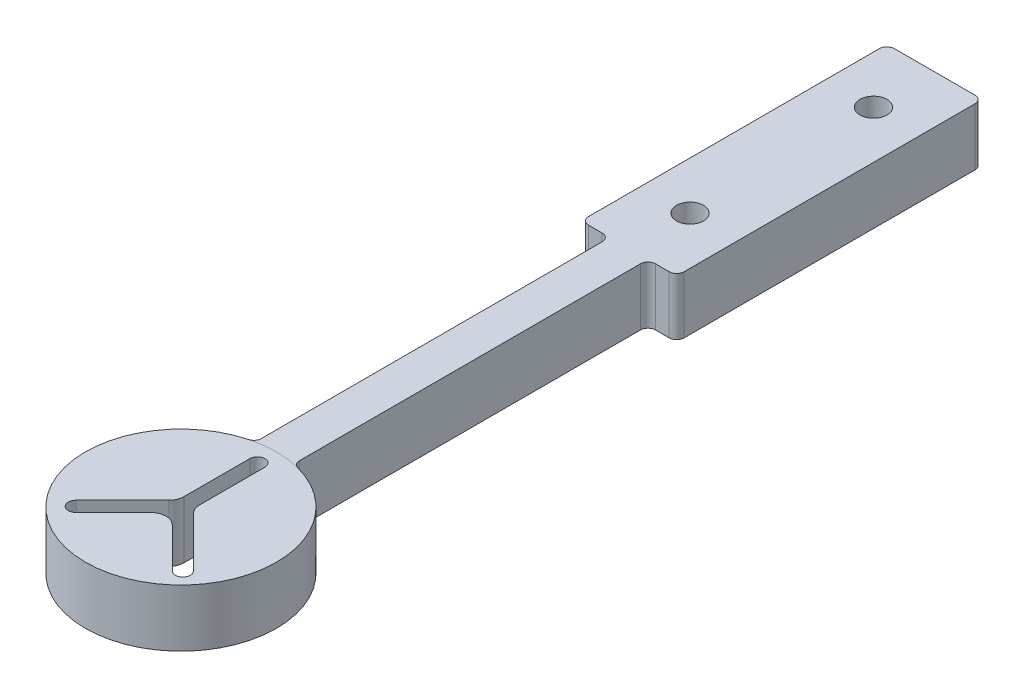
ISO-10303-21;
HEADER;
FILE_DESCRIPTION(('STEP AP214'),'2;1');
FILE_NAME('part.step','',(''),(''),'','','');
FILE_SCHEMA(('AUTOMOTIVE_DESIGN { 1 0 10303 214 1 1 1 1 }'));
ENDSEC;
DATA;
#1=APPLICATION_CONTEXT('core data for automotive mechanical design processes');
#2=APPLICATION_PROTOCOL_DEFINITION('international standard','automotive_design',2000,#1);
#3=PRODUCT_CONTEXT('',#1,'mechanical');
#4=PRODUCT('Part','Part','',(#3));
#5=PRODUCT_RELATED_PRODUCT_CATEGORY('part','',(#4));
#6=PRODUCT_DEFINITION_FORMATION('','',#4);
#7=PRODUCT_DEFINITION_CONTEXT('part definition',#1,'design');
#8=PRODUCT_DEFINITION('design','',#6,#7);
#9=PRODUCT_DEFINITION_SHAPE('','',#8);
#10=(LENGTH_UNIT() NAMED_UNIT(*) SI_UNIT(.MILLI.,.METRE.));
#11=(NAMED_UNIT(*) PLANE_ANGLE_UNIT() SI_UNIT($,.RADIAN.));
#12=(NAMED_UNIT(*) SI_UNIT($,.STERADIAN.) SOLID_ANGLE_UNIT());
#13=UNCERTAINTY_MEASURE_WITH_UNIT(LENGTH_MEASURE(1.E-05),#10,'distance_accuracy_value','');
#14=(GEOMETRIC_REPRESENTATION_CONTEXT(3) GLOBAL_UNCERTAINTY_ASSIGNED_CONTEXT((#13)) GLOBAL_UNIT_ASSIGNED_CONTEXT((#10,
#11,#12)) REPRESENTATION_CONTEXT('',''));
#15=CARTESIAN_POINT('',(0.,0.,0.));
#16=DIRECTION('',(0.,0.,1.));
#17=DIRECTION('',(1.,0.,0.));
#18=AXIS2_PLACEMENT_3D('',#15,#16,#17);
#19=CARTESIAN_POINT('',(0.,9.525,74.422));
#20=DIRECTION('',(0.,1.,0.));
#21=DIRECTION('',(0.,0.,1.));
#22=AXIS2_PLACEMENT_3D('',#19,#20,#21);
#23=PLANE('',#22);
#24=CARTESIAN_POINT('',(0.,9.525,-40.64));
#25=DIRECTION('',(0.,1.,0.));
#26=DIRECTION('',(0.,0.,1.));
#27=AXIS2_PLACEMENT_3D('',#24,#25,#26);
#28=CIRCLE('',#27,2.2479);
#29=CARTESIAN_POINT('',(0.,9.525,-38.3921));
#30=VERTEX_POINT('',#29);
#31=EDGE_CURVE('E300',#30,#30,#28,.T.);
#32=ORIENTED_EDGE('',*,*,#31,.F.);
#33=EDGE_LOOP('',(#32));
#34=FACE_BOUND('',#33,.T.);
#35=CARTESIAN_POINT('',(0.,9.525,-10.16));
#36=DIRECTION('',(0.,1.,0.));
#37=DIRECTION('',(0.,0.,1.));
#38=AXIS2_PLACEMENT_3D('',#35,#36,#37);
#39=CIRCLE('',#38,2.2479);
#40=CARTESIAN_POINT('',(0.,9.525,-7.9121));
#41=VERTEX_POINT('',#40);
#42=EDGE_CURVE('E287',#41,#41,#39,.T.);
#43=ORIENTED_EDGE('',*,*,#42,.F.);
#44=EDGE_LOOP('',(#43));
#45=FACE_BOUND('',#44,.T.);
#46=CARTESIAN_POINT('',(-4.42499999999999,9.525,57.8785723019684));
#47=DIRECTION('',(0.,1.,0.));
#48=DIRECTION('',(0.,0.,1.));
#49=AXIS2_PLACEMENT_3D('',#46,#47,#48);
#50=CIRCLE('',#49,1.25);
#51=CARTESIAN_POINT('',(-3.17499999999999,9.525,57.8785723019684));
#52=VERTEX_POINT('',#51);
#53=CARTESIAN_POINT('',(-4.10200729927006,9.525,59.086121768978));
#54=VERTEX_POINT('',#53);
#55=EDGE_CURVE('E428',#52,#54,#50,.F.);
#56=ORIENTED_EDGE('',*,*,#55,.T.);
#57=CARTESIAN_POINT('',(0.,9.525,74.422));
#58=DIRECTION('',(0.,1.,0.));
#59=DIRECTION('',(0.,0.,1.));
#60=AXIS2_PLACEMENT_3D('',#57,#58,#59);
#61=CIRCLE('',#60,15.875);
#62=CARTESIAN_POINT('',(4.10200729927008,9.525,59.086121768978));
#63=VERTEX_POINT('',#62);
#64=EDGE_CURVE('E434',#54,#63,#61,.F.);
#65=ORIENTED_EDGE('',*,*,#64,.T.);
#66=CARTESIAN_POINT('',(4.42500000000001,9.525,57.8785723019684));
#67=DIRECTION('',(0.,1.,0.));
#68=DIRECTION('',(0.,0.,1.));
#69=AXIS2_PLACEMENT_3D('',#66,#67,#68);
#70=CIRCLE('',#69,1.25);
#71=CARTESIAN_POINT('',(3.17500000000001,9.525,57.8785723019684));
#72=VERTEX_POINT('',#71);
#73=EDGE_CURVE('E424',#63,#72,#70,.F.);
#74=ORIENTED_EDGE('',*,*,#73,.T.);
#75=DIRECTION('',(0.,0.,-1.));
#76=VECTOR('',#75,1.);
#77=CARTESIAN_POINT('',(3.175,9.525,0.));
#78=LINE('',#77,#76);
#79=CARTESIAN_POINT('',(3.175,9.525,1.25));
#80=VERTEX_POINT('',#79);
#81=EDGE_CURVE('E322',#72,#80,#78,.T.);
#82=ORIENTED_EDGE('',*,*,#81,.T.);
#83=CARTESIAN_POINT('',(4.425,9.525,1.25));
#84=DIRECTION('',(0.,1.,0.));
#85=DIRECTION('',(0.,0.,1.));
#86=AXIS2_PLACEMENT_3D('',#83,#84,#85);
#87=CIRCLE('',#86,1.25);
#88=CARTESIAN_POINT('',(4.425,9.525,0.));
#89=VERTEX_POINT('',#88);
#90=EDGE_CURVE('E420',#80,#89,#87,.F.);
#91=ORIENTED_EDGE('',*,*,#90,.T.);
#92=DIRECTION('',(1.,0.,0.));
#93=VECTOR('',#92,1.);
#94=CARTESIAN_POINT('',(3.175,9.525,0.));
#95=LINE('',#94,#93);
#96=CARTESIAN_POINT('',(6.6875,9.525,0.));
#97=VERTEX_POINT('',#96);
#98=EDGE_CURVE('E325',#89,#97,#95,.T.);
#99=ORIENTED_EDGE('',*,*,#98,.T.);
#100=CARTESIAN_POINT('',(6.6875,9.525,-1.25));
#101=DIRECTION('',(0.,1.,0.));
#102=DIRECTION('',(0.,0.,1.));
#103=AXIS2_PLACEMENT_3D('',#100,#101,#102);
#104=CIRCLE('',#103,1.25);
#105=CARTESIAN_POINT('',(7.9375,9.525,-1.25));
#106=VERTEX_POINT('',#105);
#107=EDGE_CURVE('E374',#97,#106,#104,.T.);
#108=ORIENTED_EDGE('',*,*,#107,.T.);
#109=DIRECTION('',(0.,0.,-1.));
#110=VECTOR('',#109,1.);
#111=CARTESIAN_POINT('',(7.9375,9.525,-50.8));
#112=LINE('',#111,#110);
#113=CARTESIAN_POINT('',(7.9375,9.525,-49.55));
#114=VERTEX_POINT('',#113);
#115=EDGE_CURVE('E328',#106,#114,#112,.T.);
#116=ORIENTED_EDGE('',*,*,#115,.T.);
#117=CARTESIAN_POINT('',(6.6875,9.525,-49.55));
#118=DIRECTION('',(0.,1.,0.));
#119=DIRECTION('',(0.,0.,1.));
#120=AXIS2_PLACEMENT_3D('',#117,#118,#119);
#121=CIRCLE('',#120,1.25);
#122=CARTESIAN_POINT('',(6.6875,9.525,-50.8));
#123=VERTEX_POINT('',#122);
#124=EDGE_CURVE('E380',#114,#123,#121,.T.);
#125=ORIENTED_EDGE('',*,*,#124,.T.);
#126=DIRECTION('',(-1.,0.,0.));
#127=VECTOR('',#126,1.);
#128=CARTESIAN_POINT('',(-7.9375,9.525,-50.8));
#129=LINE('',#128,#127);
#130=CARTESIAN_POINT('',(-6.6875,9.525,-50.8));
#131=VERTEX_POINT('',#130);
#132=EDGE_CURVE('E331',#123,#131,#129,.T.);
#133=ORIENTED_EDGE('',*,*,#132,.T.);
#134=CARTESIAN_POINT('',(-6.6875,9.525,-49.55));
#135=DIRECTION('',(0.,1.,0.));
#136=DIRECTION('',(0.,0.,1.));
#137=AXIS2_PLACEMENT_3D('',#134,#135,#136);
#138=CIRCLE('',#137,1.25);
#139=CARTESIAN_POINT('',(-7.9375,9.525,-49.55));
#140=VERTEX_POINT('',#139);
#141=EDGE_CURVE('E378',#131,#140,#138,.T.);
#142=ORIENTED_EDGE('',*,*,#141,.T.);
#143=DIRECTION('',(0.,0.,1.));
#144=VECTOR('',#143,1.);
#145=CARTESIAN_POINT('',(-7.9375,9.525,-50.8));
#146=LINE('',#145,#144);
#147=CARTESIAN_POINT('',(-7.93749999999999,9.525,-1.25));
#148=VERTEX_POINT('',#147);
#149=EDGE_CURVE('E309',#140,#148,#146,.T.);
#150=ORIENTED_EDGE('',*,*,#149,.T.);
#151=CARTESIAN_POINT('',(-6.68749999999999,9.525,-1.25));
#152=DIRECTION('',(0.,1.,0.));
#153=DIRECTION('',(0.,0.,1.));
#154=AXIS2_PLACEMENT_3D('',#151,#152,#153);
#155=CIRCLE('',#154,1.25);
#156=CARTESIAN_POINT('',(-6.68749999999999,9.525,0.));
#157=VERTEX_POINT('',#156);
#158=EDGE_CURVE('E376',#148,#157,#155,.T.);
#159=ORIENTED_EDGE('',*,*,#158,.T.);
#160=DIRECTION('',(1.,0.,0.));
#161=VECTOR('',#160,1.);
#162=CARTESIAN_POINT('',(-7.93749999999999,9.525,0.));
#163=LINE('',#162,#161);
#164=CARTESIAN_POINT('',(-4.425,9.525,0.));
#165=VERTEX_POINT('',#164);
#166=EDGE_CURVE('E312',#157,#165,#163,.T.);
#167=ORIENTED_EDGE('',*,*,#166,.T.);
#168=CARTESIAN_POINT('',(-4.425,9.525,1.25));
#169=DIRECTION('',(0.,1.,0.));
#170=DIRECTION('',(0.,0.,1.));
#171=AXIS2_PLACEMENT_3D('',#168,#169,#170);
#172=CIRCLE('',#171,1.25);
#173=CARTESIAN_POINT('',(-3.175,9.525,1.25));
#174=VERTEX_POINT('',#173);
#175=EDGE_CURVE('E416',#165,#174,#172,.F.);
#176=ORIENTED_EDGE('',*,*,#175,.T.);
#177=DIRECTION('',(0.,0.,1.));
#178=VECTOR('',#177,1.);
#179=CARTESIAN_POINT('',(-3.175,9.525,0.));
#180=LINE('',#179,#178);
#181=EDGE_CURVE('E316',#174,#52,#180,.T.);
#182=ORIENTED_EDGE('',*,*,#181,.T.);
#183=EDGE_LOOP('',(#56,#65,#74,#82,#91,#99,#108,#116,#125,#133,#142,#150,#159,#167,#176,#182));
#184=FACE_BOUND('',#183,.T.);
#185=ADVANCED_FACE('F37',(#34,#45,#184),#23,.T.);
#186=CARTESIAN_POINT('',(0.,0.,74.422));
#187=DIRECTION('',(0.,1.,0.));
#188=DIRECTION('',(0.,0.,1.));
#189=AXIS2_PLACEMENT_3D('',#186,#187,#188);
#190=PLANE('',#189);
#191=DIRECTION('',(0.707106781186545,0.,-0.70710678118655));
#192=VECTOR('',#191,1.);
#193=CARTESIAN_POINT('',(0.0599749821796596,0.,75.9191152722462));
#194=LINE('',#193,#192);
#195=CARTESIAN_POINT('',(-7.95662009902812,0.,83.9357103534541));
#196=VERTEX_POINT('',#195);
#197=CARTESIAN_POINT('',(-1.73607624203418,0.,77.7151664964601));
#198=VERTEX_POINT('',#197);
#199=EDGE_CURVE('E257',#196,#198,#194,.T.);
#200=ORIENTED_EDGE('',*,*,#199,.T.);
#201=CARTESIAN_POINT('',(0.059974982179657,0.,79.5112177206739));
#202=DIRECTION('',(0.,1.,0.));
#203=DIRECTION('',(0.,0.,1.));
#204=AXIS2_PLACEMENT_3D('',#201,#202,#203);
#205=CIRCLE('',#204,2.54);
#206=CARTESIAN_POINT('',(1.85602620639349,0.,77.7151664964601));
#207=VERTEX_POINT('',#206);
#208=EDGE_CURVE('E450',#198,#207,#205,.F.);
#209=ORIENTED_EDGE('',*,*,#208,.T.);
#210=DIRECTION('',(0.707106781186544,0.,0.707106781186551));
#211=VECTOR('',#210,1.);
#212=CARTESIAN_POINT('',(0.0599749821796596,0.,75.9191152722462));
#213=LINE('',#212,#211);
#214=CARTESIAN_POINT('',(8.47215029875796,0.,84.3312905888246));
#215=VERTEX_POINT('',#214);
#216=EDGE_CURVE('E259',#207,#215,#213,.T.);
#217=ORIENTED_EDGE('',*,*,#216,.T.);
#218=CARTESIAN_POINT('',(9.35221539862274,0.,83.4512254889598));
#219=DIRECTION('',(0.,1.,0.));
#220=DIRECTION('',(0.,0.,-1.));
#221=AXIS2_PLACEMENT_3D('',#218,#219,#220);
#222=CIRCLE('',#221,1.2446);
#223=CARTESIAN_POINT('',(10.2322804984875,0.,82.5711603890951));
#224=VERTEX_POINT('',#223);
#225=EDGE_CURVE('E261',#215,#224,#222,.T.);
#226=ORIENTED_EDGE('',*,*,#225,.T.);
#227=DIRECTION('',(-0.707106781186544,0.,-0.707106781186551));
#228=VECTOR('',#227,1.);
#229=CARTESIAN_POINT('',(1.2446,0.,73.5834798906074));
#230=LINE('',#229,#228);
#231=CARTESIAN_POINT('',(1.98854877578616,0.,74.3274286663936));
#232=VERTEX_POINT('',#231);
#233=EDGE_CURVE('E244',#224,#232,#230,.T.);
#234=ORIENTED_EDGE('',*,*,#233,.T.);
#235=CARTESIAN_POINT('',(3.7846,0.,72.5313774421798));
#236=DIRECTION('',(0.,1.,0.));
#237=DIRECTION('',(0.,0.,1.));
#238=AXIS2_PLACEMENT_3D('',#235,#236,#237);
#239=CIRCLE('',#238,2.54);
#240=CARTESIAN_POINT('',(1.2446,0.,72.5313774421798));
#241=VERTEX_POINT('',#240);
#242=EDGE_CURVE('E229',#232,#241,#239,.F.);
#243=ORIENTED_EDGE('',*,*,#242,.T.);
#244=DIRECTION('',(0.,0.,-1.));
#245=VECTOR('',#244,1.);
#246=CARTESIAN_POINT('',(1.2446,0.,73.5834798906074));
#247=LINE('',#246,#245);
#248=CARTESIAN_POINT('',(1.2446,0.,61.722));
#249=VERTEX_POINT('',#248);
#250=EDGE_CURVE('E220',#241,#249,#247,.T.);
#251=ORIENTED_EDGE('',*,*,#250,.T.);
#252=CARTESIAN_POINT('',(0.,0.,61.722));
#253=DIRECTION('',(0.,1.,0.));
#254=DIRECTION('',(0.,0.,-1.));
#255=AXIS2_PLACEMENT_3D('',#252,#253,#254);
#256=CIRCLE('',#255,1.2446);
#257=CARTESIAN_POINT('',(-1.2446,0.,61.722));
#258=VERTEX_POINT('',#257);
#259=EDGE_CURVE('E226',#249,#258,#256,.T.);
#260=ORIENTED_EDGE('',*,*,#259,.T.);
#261=DIRECTION('',(0.,0.,1.));
#262=VECTOR('',#261,1.);
#263=CARTESIAN_POINT('',(-1.2446,0.,73.7034298549668));
#264=LINE('',#263,#262);
#265=CARTESIAN_POINT('',(-1.2446,0.,72.6513274065391));
#266=VERTEX_POINT('',#265);
#267=EDGE_CURVE('E248',#258,#266,#264,.T.);
#268=ORIENTED_EDGE('',*,*,#267,.T.);
#269=CARTESIAN_POINT('',(-3.7846,0.,72.6513274065391));
#270=DIRECTION('',(0.,1.,0.));
#271=DIRECTION('',(0.,0.,1.));
#272=AXIS2_PLACEMENT_3D('',#269,#270,#271);
#273=CIRCLE('',#272,2.54);
#274=CARTESIAN_POINT('',(-1.98854877578616,0.,74.4473786307529));
#275=VERTEX_POINT('',#274);
#276=EDGE_CURVE('E52',#266,#275,#273,.F.);
#277=ORIENTED_EDGE('',*,*,#276,.T.);
#278=DIRECTION('',(-0.707106781186544,0.,0.707106781186551));
#279=VECTOR('',#278,1.);
#280=CARTESIAN_POINT('',(-1.2446,0.,73.7034298549668));
#281=LINE('',#280,#279);
#282=CARTESIAN_POINT('',(-9.71675029875767,0.,82.1755801537245));
#283=VERTEX_POINT('',#282);
#284=EDGE_CURVE('E250',#275,#283,#281,.T.);
#285=ORIENTED_EDGE('',*,*,#284,.T.);
#286=CARTESIAN_POINT('',(-8.83668519889291,0.,83.0556452535893));
#287=DIRECTION('',(0.,1.,0.));
#288=DIRECTION('',(0.,0.,-1.));
#289=AXIS2_PLACEMENT_3D('',#286,#287,#288);
#290=CIRCLE('',#289,1.24459999999999);
#291=EDGE_CURVE('E254',#283,#196,#290,.T.);
#292=ORIENTED_EDGE('',*,*,#291,.T.);
#293=EDGE_LOOP('',(#200,#209,#217,#226,#234,#243,#251,#260,#268,#277,#285,#292));
#294=FACE_BOUND('',#293,.T.);
#295=DIRECTION('',(-1.,0.,0.));
#296=VECTOR('',#295,1.);
#297=CARTESIAN_POINT('',(0.,0.,0.));
#298=LINE('',#297,#296);
#299=CARTESIAN_POINT('',(4.425,0.,0.));
#300=VERTEX_POINT('',#299);
#301=CARTESIAN_POINT('',(-4.425,0.,0.));
#302=VERTEX_POINT('',#301);
#303=EDGE_CURVE('E431',#300,#302,#298,.T.);
#304=ORIENTED_EDGE('',*,*,#303,.F.);
#305=CARTESIAN_POINT('',(4.425,0.,1.25));
#306=DIRECTION('',(0.,1.,0.));
#307=DIRECTION('',(0.,0.,1.));
#308=AXIS2_PLACEMENT_3D('',#305,#306,#307);
#309=CIRCLE('',#308,1.25);
#310=CARTESIAN_POINT('',(3.175,0.,1.25));
#311=VERTEX_POINT('',#310);
#312=EDGE_CURVE('E418',#300,#311,#309,.T.);
#313=ORIENTED_EDGE('',*,*,#312,.T.);
#314=DIRECTION('',(0.,0.,-1.));
#315=VECTOR('',#314,1.);
#316=CARTESIAN_POINT('',(3.175,0.,0.));
#317=LINE('',#316,#315);
#318=CARTESIAN_POINT('',(3.17500000000001,0.,57.8785723019684));
#319=VERTEX_POINT('',#318);
#320=EDGE_CURVE('E346',#319,#311,#317,.T.);
#321=ORIENTED_EDGE('',*,*,#320,.F.);
#322=CARTESIAN_POINT('',(4.42500000000001,0.,57.8785723019684));
#323=DIRECTION('',(0.,1.,0.));
#324=DIRECTION('',(0.,0.,1.));
#325=AXIS2_PLACEMENT_3D('',#322,#323,#324);
#326=CIRCLE('',#325,1.25);
#327=CARTESIAN_POINT('',(4.10200729927008,0.,59.086121768978));
#328=VERTEX_POINT('',#327);
#329=EDGE_CURVE('E422',#319,#328,#326,.T.);
#330=ORIENTED_EDGE('',*,*,#329,.T.);
#331=CARTESIAN_POINT('',(0.,0.,74.422));
#332=DIRECTION('',(0.,1.,0.));
#333=DIRECTION('',(0.,0.,1.));
#334=AXIS2_PLACEMENT_3D('',#331,#332,#333);
#335=CIRCLE('',#334,15.875);
#336=CARTESIAN_POINT('',(-4.10200729927006,0.,59.086121768978));
#337=VERTEX_POINT('',#336);
#338=EDGE_CURVE('E343',#337,#328,#335,.T.);
#339=ORIENTED_EDGE('',*,*,#338,.F.);
#340=CARTESIAN_POINT('',(-4.42499999999999,0.,57.8785723019684));
#341=DIRECTION('',(0.,1.,0.));
#342=DIRECTION('',(0.,0.,1.));
#343=AXIS2_PLACEMENT_3D('',#340,#341,#342);
#344=CIRCLE('',#343,1.25);
#345=CARTESIAN_POINT('',(-3.17499999999999,0.,57.8785723019684));
#346=VERTEX_POINT('',#345);
#347=EDGE_CURVE('E426',#337,#346,#344,.T.);
#348=ORIENTED_EDGE('',*,*,#347,.T.);
#349=DIRECTION('',(0.,0.,1.));
#350=VECTOR('',#349,1.);
#351=CARTESIAN_POINT('',(-3.175,0.,0.));
#352=LINE('',#351,#350);
#353=CARTESIAN_POINT('',(-3.175,0.,1.25));
#354=VERTEX_POINT('',#353);
#355=EDGE_CURVE('E340',#354,#346,#352,.T.);
#356=ORIENTED_EDGE('',*,*,#355,.F.);
#357=CARTESIAN_POINT('',(-4.425,0.,1.25));
#358=DIRECTION('',(0.,1.,0.));
#359=DIRECTION('',(0.,0.,1.));
#360=AXIS2_PLACEMENT_3D('',#357,#358,#359);
#361=CIRCLE('',#360,1.25);
#362=EDGE_CURVE('E413',#354,#302,#361,.T.);
#363=ORIENTED_EDGE('',*,*,#362,.T.);
#364=EDGE_LOOP('',(#304,#313,#321,#330,#339,#348,#356,#363));
#365=FACE_BOUND('',#364,.T.);
#366=ADVANCED_FACE('F223',(#294,#365),#190,.F.);
#367=CARTESIAN_POINT('',(-7.9375,9.525,-50.8));
#368=DIRECTION('',(1.,0.,0.));
#369=DIRECTION('',(0.,0.,-1.));
#370=AXIS2_PLACEMENT_3D('',#367,#368,#369);
#371=PLANE('',#370);
#372=ORIENTED_EDGE('',*,*,#149,.F.);
#373=DIRECTION('',(0.,-1.,0.));
#374=VECTOR('',#373,1.);
#375=CARTESIAN_POINT('',(-7.9375,9.525,-49.55));
#376=LINE('',#375,#374);
#377=CARTESIAN_POINT('',(-7.9375,0.,-49.55));
#378=VERTEX_POINT('',#377);
#379=EDGE_CURVE('E384',#140,#378,#376,.T.);
#380=ORIENTED_EDGE('',*,*,#379,.T.);
#381=DIRECTION('',(0.,0.,1.));
#382=VECTOR('',#381,1.);
#383=CARTESIAN_POINT('',(-7.9375,0.,-50.8));
#384=LINE('',#383,#382);
#385=CARTESIAN_POINT('',(-7.93749999999999,0.,-1.25));
#386=VERTEX_POINT('',#385);
#387=EDGE_CURVE('E306',#378,#386,#384,.T.);
#388=ORIENTED_EDGE('',*,*,#387,.T.);
#389=DIRECTION('',(0.,-1.,0.));
#390=VECTOR('',#389,1.);
#391=CARTESIAN_POINT('',(-7.93749999999999,9.525,-1.25));
#392=LINE('',#391,#390);
#393=EDGE_CURVE('E382',#386,#148,#392,.F.);
#394=ORIENTED_EDGE('',*,*,#393,.T.);
#395=EDGE_LOOP('',(#372,#380,#388,#394));
#396=FACE_BOUND('',#395,.T.);
#397=ADVANCED_FACE('F503',(#396),#371,.F.);
#398=CARTESIAN_POINT('',(-7.93749999999999,9.525,0.));
#399=DIRECTION('',(0.,0.,-1.));
#400=DIRECTION('',(-1.,0.,0.));
#401=AXIS2_PLACEMENT_3D('',#398,#399,#400);
#402=PLANE('',#401);
#403=ORIENTED_EDGE('',*,*,#166,.F.);
#404=DIRECTION('',(0.,-1.,0.));
#405=VECTOR('',#404,1.);
#406=CARTESIAN_POINT('',(-6.68749999999999,9.525,0.));
#407=LINE('',#406,#405);
#408=CARTESIAN_POINT('',(-6.68749999999999,0.,0.));
#409=VERTEX_POINT('',#408);
#410=EDGE_CURVE('E389',#157,#409,#407,.T.);
#411=ORIENTED_EDGE('',*,*,#410,.T.);
#412=DIRECTION('',(1.,0.,0.));
#413=VECTOR('',#412,1.);
#414=CARTESIAN_POINT('',(-7.93749999999999,0.,0.));
#415=LINE('',#414,#413);
#416=EDGE_CURVE('E337',#409,#302,#415,.T.);
#417=ORIENTED_EDGE('',*,*,#416,.T.);
#418=DIRECTION('',(0.,-1.,0.));
#419=VECTOR('',#418,1.);
#420=CARTESIAN_POINT('',(-4.425,9.525,0.));
#421=LINE('',#420,#419);
#422=EDGE_CURVE('E387',#302,#165,#421,.F.);
#423=ORIENTED_EDGE('',*,*,#422,.T.);
#424=EDGE_LOOP('',(#403,#411,#417,#423));
#425=FACE_BOUND('',#424,.T.);
#426=ADVANCED_FACE('F546',(#425),#402,.F.);
#427=CARTESIAN_POINT('',(-3.175,9.525,0.));
#428=DIRECTION('',(1.,0.,0.));
#429=DIRECTION('',(0.,0.,-1.));
#430=AXIS2_PLACEMENT_3D('',#427,#428,#429);
#431=PLANE('',#430);
#432=ORIENTED_EDGE('',*,*,#181,.F.);
#433=DIRECTION('',(0.,-1.,0.));
#434=VECTOR('',#433,1.);
#435=CARTESIAN_POINT('',(-3.175,0.,1.25));
#436=LINE('',#435,#434);
#437=EDGE_CURVE('E394',#174,#354,#436,.T.);
#438=ORIENTED_EDGE('',*,*,#437,.T.);
#439=ORIENTED_EDGE('',*,*,#355,.T.);
#440=DIRECTION('',(0.,1.,0.));
#441=VECTOR('',#440,1.);
#442=CARTESIAN_POINT('',(-3.17499999999999,9.525,57.8785723019684));
#443=LINE('',#442,#441);
#444=EDGE_CURVE('E392',#346,#52,#443,.T.);
#445=ORIENTED_EDGE('',*,*,#444,.T.);
#446=EDGE_LOOP('',(#432,#438,#439,#445));
#447=FACE_BOUND('',#446,.T.);
#448=ADVANCED_FACE('F536',(#447),#431,.F.);
#449=CARTESIAN_POINT('',(0.,9.525,74.422));
#450=DIRECTION('',(0.,-1.,0.));
#451=DIRECTION('',(0.,0.,-1.));
#452=AXIS2_PLACEMENT_3D('',#449,#450,#451);
#453=CYLINDRICAL_SURFACE('',#452,15.875);
#454=ORIENTED_EDGE('',*,*,#338,.T.);
#455=DIRECTION('',(0.,-1.,0.));
#456=VECTOR('',#455,1.);
#457=CARTESIAN_POINT('',(4.10200729927008,9.525,59.086121768978));
#458=LINE('',#457,#456);
#459=EDGE_CURVE('E410',#328,#63,#458,.F.);
#460=ORIENTED_EDGE('',*,*,#459,.T.);
#461=CARTESIAN_POINT('',(0.,9.525,74.422));
#462=DIRECTION('',(0.,1.,0.));
#463=DIRECTION('',(0.,0.,1.));
#464=AXIS2_PLACEMENT_3D('',#461,#462,#463);
#465=CIRCLE('',#464,15.875);
#466=EDGE_CURVE('E319',#54,#63,#465,.T.);
#467=ORIENTED_EDGE('',*,*,#466,.F.);
#468=DIRECTION('',(0.,-1.,0.));
#469=VECTOR('',#468,1.);
#470=CARTESIAN_POINT('',(-4.10200729927006,9.525,59.086121768978));
#471=LINE('',#470,#469);
#472=EDGE_CURVE('E407',#54,#337,#471,.T.);
#473=ORIENTED_EDGE('',*,*,#472,.T.);
#474=EDGE_LOOP('',(#454,#460,#467,#473));
#475=FACE_BOUND('',#474,.T.);
#476=ADVANCED_FACE('F530',(#475),#453,.T.);
#477=CARTESIAN_POINT('',(3.175,9.525,0.));
#478=DIRECTION('',(-1.,0.,0.));
#479=DIRECTION('',(0.,0.,1.));
#480=AXIS2_PLACEMENT_3D('',#477,#478,#479);
#481=PLANE('',#480);
#482=ORIENTED_EDGE('',*,*,#320,.T.);
#483=DIRECTION('',(0.,-1.,0.));
#484=VECTOR('',#483,1.);
#485=CARTESIAN_POINT('',(3.175,9.525,1.25));
#486=LINE('',#485,#484);
#487=EDGE_CURVE('E405',#311,#80,#486,.F.);
#488=ORIENTED_EDGE('',*,*,#487,.T.);
#489=ORIENTED_EDGE('',*,*,#81,.F.);
#490=DIRECTION('',(0.,1.,0.));
#491=VECTOR('',#490,1.);
#492=CARTESIAN_POINT('',(3.17500000000001,0.,57.8785723019684));
#493=LINE('',#492,#491);
#494=EDGE_CURVE('E402',#72,#319,#493,.F.);
#495=ORIENTED_EDGE('',*,*,#494,.T.);
#496=EDGE_LOOP('',(#482,#488,#489,#495));
#497=FACE_BOUND('',#496,.T.);
#498=ADVANCED_FACE('F799',(#497),#481,.F.);
#499=CARTESIAN_POINT('',(3.175,9.525,0.));
#500=DIRECTION('',(0.,0.,-1.));
#501=DIRECTION('',(-1.,0.,0.));
#502=AXIS2_PLACEMENT_3D('',#499,#500,#501);
#503=PLANE('',#502);
#504=DIRECTION('',(1.,0.,0.));
#505=VECTOR('',#504,1.);
#506=CARTESIAN_POINT('',(3.175,0.,0.));
#507=LINE('',#506,#505);
#508=CARTESIAN_POINT('',(6.6875,0.,0.));
#509=VERTEX_POINT('',#508);
#510=EDGE_CURVE('E349',#300,#509,#507,.T.);
#511=ORIENTED_EDGE('',*,*,#510,.T.);
#512=DIRECTION('',(0.,-1.,0.));
#513=VECTOR('',#512,1.);
#514=CARTESIAN_POINT('',(6.6875,9.525,0.));
#515=LINE('',#514,#513);
#516=EDGE_CURVE('E400',#509,#97,#515,.F.);
#517=ORIENTED_EDGE('',*,*,#516,.T.);
#518=ORIENTED_EDGE('',*,*,#98,.F.);
#519=DIRECTION('',(0.,-1.,0.));
#520=VECTOR('',#519,1.);
#521=CARTESIAN_POINT('',(4.425,0.,0.));
#522=LINE('',#521,#520);
#523=EDGE_CURVE('E397',#89,#300,#522,.T.);
#524=ORIENTED_EDGE('',*,*,#523,.T.);
#525=EDGE_LOOP('',(#511,#517,#518,#524));
#526=FACE_BOUND('',#525,.T.);
#527=ADVANCED_FACE('F554',(#526),#503,.F.);
#528=CARTESIAN_POINT('',(7.9375,9.525,-50.8));
#529=DIRECTION('',(-1.,0.,0.));
#530=DIRECTION('',(0.,0.,1.));
#531=AXIS2_PLACEMENT_3D('',#528,#529,#530);
#532=PLANE('',#531);
#533=DIRECTION('',(0.,0.,-1.));
#534=VECTOR('',#533,1.);
#535=CARTESIAN_POINT('',(7.9375,0.,-50.8));
#536=LINE('',#535,#534);
#537=CARTESIAN_POINT('',(7.9375,0.,-1.25));
#538=VERTEX_POINT('',#537);
#539=CARTESIAN_POINT('',(7.9375,0.,-49.55));
#540=VERTEX_POINT('',#539);
#541=EDGE_CURVE('E352',#538,#540,#536,.T.);
#542=ORIENTED_EDGE('',*,*,#541,.T.);
#543=DIRECTION('',(0.,-1.,0.));
#544=VECTOR('',#543,1.);
#545=CARTESIAN_POINT('',(7.9375,9.525,-49.55));
#546=LINE('',#545,#544);
#547=EDGE_CURVE('E372',#540,#114,#546,.F.);
#548=ORIENTED_EDGE('',*,*,#547,.T.);
#549=ORIENTED_EDGE('',*,*,#115,.F.);
#550=DIRECTION('',(0.,-1.,0.));
#551=VECTOR('',#550,1.);
#552=CARTESIAN_POINT('',(7.9375,9.525,-1.25));
#553=LINE('',#552,#551);
#554=EDGE_CURVE('E369',#106,#538,#553,.T.);
#555=ORIENTED_EDGE('',*,*,#554,.T.);
#556=EDGE_LOOP('',(#542,#548,#549,#555));
#557=FACE_BOUND('',#556,.T.);
#558=ADVANCED_FACE('F518',(#557),#532,.F.);
#559=CARTESIAN_POINT('',(-7.9375,9.525,-50.8));
#560=DIRECTION('',(0.,0.,1.));
#561=DIRECTION('',(1.,0.,0.));
#562=AXIS2_PLACEMENT_3D('',#559,#560,#561);
#563=PLANE('',#562);
#564=ORIENTED_EDGE('',*,*,#132,.F.);
#565=DIRECTION('',(0.,-1.,0.));
#566=VECTOR('',#565,1.);
#567=CARTESIAN_POINT('',(6.6875,9.525,-50.8));
#568=LINE('',#567,#566);
#569=CARTESIAN_POINT('',(6.6875,0.,-50.8));
#570=VERTEX_POINT('',#569);
#571=EDGE_CURVE('E358',#123,#570,#568,.T.);
#572=ORIENTED_EDGE('',*,*,#571,.T.);
#573=DIRECTION('',(-1.,0.,0.));
#574=VECTOR('',#573,1.);
#575=CARTESIAN_POINT('',(-7.9375,0.,-50.8));
#576=LINE('',#575,#574);
#577=CARTESIAN_POINT('',(-6.6875,0.,-50.8));
#578=VERTEX_POINT('',#577);
#579=EDGE_CURVE('E313',#570,#578,#576,.T.);
#580=ORIENTED_EDGE('',*,*,#579,.T.);
#581=DIRECTION('',(0.,-1.,0.));
#582=VECTOR('',#581,1.);
#583=CARTESIAN_POINT('',(-6.6875,9.525,-50.8));
#584=LINE('',#583,#582);
#585=EDGE_CURVE('E334',#578,#131,#584,.F.);
#586=ORIENTED_EDGE('',*,*,#585,.T.);
#587=EDGE_LOOP('',(#564,#572,#580,#586));
#588=FACE_BOUND('',#587,.T.);
#589=ADVANCED_FACE('F510',(#588),#563,.F.);
#590=ORIENTED_EDGE('',*,*,#64,.F.);
#591=ORIENTED_EDGE('',*,*,#466,.T.);
#592=EDGE_LOOP('',(#590,#591));
#593=FACE_BOUND('',#592,.T.);
#594=DIRECTION('',(0.707106781186544,0.,0.707106781186551));
#595=VECTOR('',#594,1.);
#596=CARTESIAN_POINT('',(0.0599749821796596,9.525,75.9191152722462));
#597=LINE('',#596,#595);
#598=CARTESIAN_POINT('',(1.85602620639349,9.525,77.7151664964601));
#599=VERTEX_POINT('',#598);
#600=CARTESIAN_POINT('',(8.47215029875796,9.525,84.3312905888246));
#601=VERTEX_POINT('',#600);
#602=EDGE_CURVE('E278',#599,#601,#597,.T.);
#603=ORIENTED_EDGE('',*,*,#602,.F.);
#604=CARTESIAN_POINT('',(0.059974982179657,9.525,79.5112177206739));
#605=DIRECTION('',(0.,1.,0.));
#606=DIRECTION('',(0.,0.,1.));
#607=AXIS2_PLACEMENT_3D('',#604,#605,#606);
#608=CIRCLE('',#607,2.54);
#609=CARTESIAN_POINT('',(-1.73607624203418,9.525,77.7151664964601));
#610=VERTEX_POINT('',#609);
#611=EDGE_CURVE('E444',#599,#610,#608,.T.);
#612=ORIENTED_EDGE('',*,*,#611,.T.);
#613=DIRECTION('',(0.707106781186545,0.,-0.70710678118655));
#614=VECTOR('',#613,1.);
#615=CARTESIAN_POINT('',(0.0599749821796596,9.525,75.9191152722462));
#616=LINE('',#615,#614);
#617=CARTESIAN_POINT('',(-7.95662009902812,9.525,83.9357103534541));
#618=VERTEX_POINT('',#617);
#619=EDGE_CURVE('E275',#618,#610,#616,.T.);
#620=ORIENTED_EDGE('',*,*,#619,.F.);
#621=CARTESIAN_POINT('',(-8.83668519889291,9.525,83.0556452535893));
#622=DIRECTION('',(0.,1.,0.));
#623=DIRECTION('',(0.,0.,-1.));
#624=AXIS2_PLACEMENT_3D('',#621,#622,#623);
#625=CIRCLE('',#624,1.24459999999999);
#626=CARTESIAN_POINT('',(-9.71675029875767,9.525,82.1755801537245));
#627=VERTEX_POINT('',#626);
#628=EDGE_CURVE('E272',#627,#618,#625,.T.);
#629=ORIENTED_EDGE('',*,*,#628,.F.);
#630=DIRECTION('',(-0.707106781186544,0.,0.707106781186551));
#631=VECTOR('',#630,1.);
#632=CARTESIAN_POINT('',(-1.2446,9.525,73.7034298549668));
#633=LINE('',#632,#631);
#634=CARTESIAN_POINT('',(-1.98854877578616,9.525,74.4473786307529));
#635=VERTEX_POINT('',#634);
#636=EDGE_CURVE('E270',#635,#627,#633,.T.);
#637=ORIENTED_EDGE('',*,*,#636,.F.);
#638=CARTESIAN_POINT('',(-3.7846,9.525,72.6513274065391));
#639=DIRECTION('',(0.,1.,0.));
#640=DIRECTION('',(0.,0.,1.));
#641=AXIS2_PLACEMENT_3D('',#638,#639,#640);
#642=CIRCLE('',#641,2.54);
#643=CARTESIAN_POINT('',(-1.2446,9.525,72.6513274065391));
#644=VERTEX_POINT('',#643);
#645=EDGE_CURVE('E440',#635,#644,#642,.T.);
#646=ORIENTED_EDGE('',*,*,#645,.T.);
#647=DIRECTION('',(0.,0.,1.));
#648=VECTOR('',#647,1.);
#649=CARTESIAN_POINT('',(-1.2446,9.525,73.7034298549668));
#650=LINE('',#649,#648);
#651=CARTESIAN_POINT('',(-1.2446,9.525,61.722));
#652=VERTEX_POINT('',#651);
#653=EDGE_CURVE('E268',#652,#644,#650,.T.);
#654=ORIENTED_EDGE('',*,*,#653,.F.);
#655=CARTESIAN_POINT('',(0.,9.525,61.722));
#656=DIRECTION('',(0.,1.,0.));
#657=DIRECTION('',(0.,0.,-1.));
#658=AXIS2_PLACEMENT_3D('',#655,#656,#657);
#659=CIRCLE('',#658,1.2446);
#660=CARTESIAN_POINT('',(1.2446,9.525,61.722));
#661=VERTEX_POINT('',#660);
#662=EDGE_CURVE('E266',#661,#652,#659,.T.);
#663=ORIENTED_EDGE('',*,*,#662,.F.);
#664=DIRECTION('',(0.,0.,-1.));
#665=VECTOR('',#664,1.);
#666=CARTESIAN_POINT('',(1.2446,9.525,73.5834798906074));
#667=LINE('',#666,#665);
#668=CARTESIAN_POINT('',(1.2446,9.525,72.5313774421798));
#669=VERTEX_POINT('',#668);
#670=EDGE_CURVE('E239',#669,#661,#667,.T.);
#671=ORIENTED_EDGE('',*,*,#670,.F.);
#672=CARTESIAN_POINT('',(3.7846,9.525,72.5313774421798));
#673=DIRECTION('',(0.,1.,0.));
#674=DIRECTION('',(0.,0.,1.));
#675=AXIS2_PLACEMENT_3D('',#672,#673,#674);
#676=CIRCLE('',#675,2.54);
#677=CARTESIAN_POINT('',(1.98854877578616,9.525,74.3274286663936));
#678=VERTEX_POINT('',#677);
#679=EDGE_CURVE('E442',#669,#678,#676,.T.);
#680=ORIENTED_EDGE('',*,*,#679,.T.);
#681=DIRECTION('',(-0.707106781186544,0.,-0.707106781186551));
#682=VECTOR('',#681,1.);
#683=CARTESIAN_POINT('',(1.2446,9.525,73.5834798906074));
#684=LINE('',#683,#682);
#685=CARTESIAN_POINT('',(10.2322804984875,9.525,82.5711603890951));
#686=VERTEX_POINT('',#685);
#687=EDGE_CURVE('E233',#686,#678,#684,.T.);
#688=ORIENTED_EDGE('',*,*,#687,.F.);
#689=CARTESIAN_POINT('',(9.35221539862274,9.525,83.4512254889598));
#690=DIRECTION('',(0.,1.,0.));
#691=DIRECTION('',(0.,0.,-1.));
#692=AXIS2_PLACEMENT_3D('',#689,#690,#691);
#693=CIRCLE('',#692,1.2446);
#694=EDGE_CURVE('E280',#601,#686,#693,.T.);
#695=ORIENTED_EDGE('',*,*,#694,.F.);
#696=EDGE_LOOP('',(#603,#612,#620,#629,#637,#646,#654,#663,#671,#680,#688,#695));
#697=FACE_BOUND('',#696,.T.);
#698=ADVANCED_FACE('F465',(#593,#697),#23,.T.);
#699=CARTESIAN_POINT('',(0.,0.,-10.16));
#700=DIRECTION('',(0.,1.,0.));
#701=DIRECTION('',(0.,0.,1.));
#702=AXIS2_PLACEMENT_3D('',#699,#700,#701);
#703=CIRCLE('',#702,2.2479);
#704=CARTESIAN_POINT('',(0.,0.,-7.9121));
#705=VERTEX_POINT('',#704);
#706=EDGE_CURVE('E297',#705,#705,#703,.T.);
#707=ORIENTED_EDGE('',*,*,#706,.T.);
#708=EDGE_LOOP('',(#707));
#709=FACE_BOUND('',#708,.T.);
#710=CARTESIAN_POINT('',(0.,0.,-40.64));
#711=DIRECTION('',(0.,1.,0.));
#712=DIRECTION('',(0.,0.,1.));
#713=AXIS2_PLACEMENT_3D('',#710,#711,#712);
#714=CIRCLE('',#713,2.2479);
#715=CARTESIAN_POINT('',(0.,0.,-38.3921));
#716=VERTEX_POINT('',#715);
#717=EDGE_CURVE('E303',#716,#716,#714,.T.);
#718=ORIENTED_EDGE('',*,*,#717,.T.);
#719=EDGE_LOOP('',(#718));
#720=FACE_BOUND('',#719,.T.);
#721=ORIENTED_EDGE('',*,*,#510,.F.);
#722=ORIENTED_EDGE('',*,*,#303,.T.);
#723=ORIENTED_EDGE('',*,*,#416,.F.);
#724=CARTESIAN_POINT('',(-6.68749999999999,0.,-1.25));
#725=DIRECTION('',(0.,1.,0.));
#726=DIRECTION('',(0.,0.,1.));
#727=AXIS2_PLACEMENT_3D('',#724,#725,#726);
#728=CIRCLE('',#727,1.25);
#729=EDGE_CURVE('E363',#409,#386,#728,.F.);
#730=ORIENTED_EDGE('',*,*,#729,.T.);
#731=ORIENTED_EDGE('',*,*,#387,.F.);
#732=CARTESIAN_POINT('',(-6.6875,0.,-49.55));
#733=DIRECTION('',(0.,1.,0.));
#734=DIRECTION('',(0.,0.,1.));
#735=AXIS2_PLACEMENT_3D('',#732,#733,#734);
#736=CIRCLE('',#735,1.25);
#737=EDGE_CURVE('E365',#378,#578,#736,.F.);
#738=ORIENTED_EDGE('',*,*,#737,.T.);
#739=ORIENTED_EDGE('',*,*,#579,.F.);
#740=CARTESIAN_POINT('',(6.6875,0.,-49.55));
#741=DIRECTION('',(0.,1.,0.));
#742=DIRECTION('',(0.,0.,1.));
#743=AXIS2_PLACEMENT_3D('',#740,#741,#742);
#744=CIRCLE('',#743,1.25);
#745=EDGE_CURVE('E367',#570,#540,#744,.F.);
#746=ORIENTED_EDGE('',*,*,#745,.T.);
#747=ORIENTED_EDGE('',*,*,#541,.F.);
#748=CARTESIAN_POINT('',(6.6875,0.,-1.25));
#749=DIRECTION('',(0.,1.,0.));
#750=DIRECTION('',(0.,0.,1.));
#751=AXIS2_PLACEMENT_3D('',#748,#749,#750);
#752=CIRCLE('',#751,1.25);
#753=EDGE_CURVE('E361',#538,#509,#752,.F.);
#754=ORIENTED_EDGE('',*,*,#753,.T.);
#755=EDGE_LOOP('',(#721,#722,#723,#730,#731,#738,#739,#746,#747,#754));
#756=FACE_BOUND('',#755,.T.);
#757=ADVANCED_FACE('F505',(#709,#720,#756),#190,.F.);
#758=CARTESIAN_POINT('',(0.,0.,-40.64));
#759=DIRECTION('',(0.,1.,0.));
#760=DIRECTION('',(0.,0.,1.));
#761=AXIS2_PLACEMENT_3D('',#758,#759,#760);
#762=CYLINDRICAL_SURFACE('',#761,2.2479);
#763=ORIENTED_EDGE('',*,*,#717,.F.);
#764=EDGE_LOOP('',(#763));
#765=FACE_BOUND('',#764,.T.);
#766=ORIENTED_EDGE('',*,*,#31,.T.);
#767=EDGE_LOOP('',(#766));
#768=FACE_BOUND('',#767,.T.);
#769=ADVANCED_FACE('F516',(#765,#768),#762,.F.);
#770=CARTESIAN_POINT('',(0.,0.,-10.16));
#771=DIRECTION('',(0.,1.,0.));
#772=DIRECTION('',(0.,0.,1.));
#773=AXIS2_PLACEMENT_3D('',#770,#771,#772);
#774=CYLINDRICAL_SURFACE('',#773,2.2479);
#775=ORIENTED_EDGE('',*,*,#706,.F.);
#776=EDGE_LOOP('',(#775));
#777=FACE_BOUND('',#776,.T.);
#778=ORIENTED_EDGE('',*,*,#42,.T.);
#779=EDGE_LOOP('',(#778));
#780=FACE_BOUND('',#779,.T.);
#781=ADVANCED_FACE('F640',(#777,#780),#774,.F.);
#782=CARTESIAN_POINT('',(1.2446,0.,73.5834798906074));
#783=DIRECTION('',(1.,0.,0.));
#784=DIRECTION('',(0.,0.,-1.));
#785=AXIS2_PLACEMENT_3D('',#782,#783,#784);
#786=PLANE('',#785);
#787=ORIENTED_EDGE('',*,*,#250,.F.);
#788=DIRECTION('',(0.,1.,0.));
#789=VECTOR('',#788,1.);
#790=CARTESIAN_POINT('',(1.2446,0.,72.5313774421798));
#791=LINE('',#790,#789);
#792=EDGE_CURVE('E452',#241,#669,#791,.T.);
#793=ORIENTED_EDGE('',*,*,#792,.T.);
#794=ORIENTED_EDGE('',*,*,#670,.T.);
#795=DIRECTION('',(0.,1.,0.));
#796=VECTOR('',#795,1.);
#797=CARTESIAN_POINT('',(1.2446,0.,61.722));
#798=LINE('',#797,#796);
#799=EDGE_CURVE('E236',#249,#661,#798,.T.);
#800=ORIENTED_EDGE('',*,*,#799,.F.);
#801=EDGE_LOOP('',(#787,#793,#794,#800));
#802=FACE_BOUND('',#801,.T.);
#803=ADVANCED_FACE('F237',(#802),#786,.F.);
#804=CARTESIAN_POINT('',(1.2446,0.,73.5834798906074));
#805=DIRECTION('',(0.707106781186551,0.,-0.707106781186544));
#806=DIRECTION('',(-0.707106781186544,0.,-0.707106781186551));
#807=AXIS2_PLACEMENT_3D('',#804,#805,#806);
#808=PLANE('',#807);
#809=ORIENTED_EDGE('',*,*,#687,.T.);
#810=DIRECTION('',(0.,1.,0.));
#811=VECTOR('',#810,1.);
#812=CARTESIAN_POINT('',(1.98854877578616,0.,74.3274286663936));
#813=LINE('',#812,#811);
#814=EDGE_CURVE('E454',#678,#232,#813,.F.);
#815=ORIENTED_EDGE('',*,*,#814,.T.);
#816=ORIENTED_EDGE('',*,*,#233,.F.);
#817=DIRECTION('',(0.,1.,0.));
#818=VECTOR('',#817,1.);
#819=CARTESIAN_POINT('',(10.2322804984875,0.,82.5711603890951));
#820=LINE('',#819,#818);
#821=EDGE_CURVE('E285',#224,#686,#820,.T.);
#822=ORIENTED_EDGE('',*,*,#821,.T.);
#823=EDGE_LOOP('',(#809,#815,#816,#822));
#824=FACE_BOUND('',#823,.T.);
#825=ADVANCED_FACE('F639',(#824),#808,.F.);
#826=CARTESIAN_POINT('',(9.35221539862274,0.,83.4512254889598));
#827=DIRECTION('',(0.,1.,0.));
#828=DIRECTION('',(0.,0.,1.));
#829=AXIS2_PLACEMENT_3D('',#826,#827,#828);
#830=CYLINDRICAL_SURFACE('',#829,1.2446);
#831=ORIENTED_EDGE('',*,*,#694,.T.);
#832=ORIENTED_EDGE('',*,*,#821,.F.);
#833=ORIENTED_EDGE('',*,*,#225,.F.);
#834=DIRECTION('',(0.,1.,0.));
#835=VECTOR('',#834,1.);
#836=CARTESIAN_POINT('',(8.47215029875796,0.,84.3312905888246));
#837=LINE('',#836,#835);
#838=EDGE_CURVE('E288',#215,#601,#837,.T.);
#839=ORIENTED_EDGE('',*,*,#838,.T.);
#840=EDGE_LOOP('',(#831,#832,#833,#839));
#841=FACE_BOUND('',#840,.T.);
#842=ADVANCED_FACE('F485',(#841),#830,.F.);
#843=CARTESIAN_POINT('',(0.0599749821796596,0.,75.9191152722462));
#844=DIRECTION('',(-0.707106781186551,0.,0.707106781186544));
#845=DIRECTION('',(0.707106781186544,0.,0.707106781186551));
#846=AXIS2_PLACEMENT_3D('',#843,#844,#845);
#847=PLANE('',#846);
#848=ORIENTED_EDGE('',*,*,#216,.F.);
#849=DIRECTION('',(0.,1.,0.));
#850=VECTOR('',#849,1.);
#851=CARTESIAN_POINT('',(1.85602620639349,0.,77.7151664964601));
#852=LINE('',#851,#850);
#853=EDGE_CURVE('E437',#207,#599,#852,.T.);
#854=ORIENTED_EDGE('',*,*,#853,.T.);
#855=ORIENTED_EDGE('',*,*,#602,.T.);
#856=ORIENTED_EDGE('',*,*,#838,.F.);
#857=EDGE_LOOP('',(#848,#854,#855,#856));
#858=FACE_BOUND('',#857,.T.);
#859=ADVANCED_FACE('F480',(#858),#847,.F.);
#860=CARTESIAN_POINT('',(0.0599749821796596,0.,75.9191152722462));
#861=DIRECTION('',(0.70710678118655,0.,0.707106781186545));
#862=DIRECTION('',(0.707106781186545,0.,-0.70710678118655));
#863=AXIS2_PLACEMENT_3D('',#860,#861,#862);
#864=PLANE('',#863);
#865=ORIENTED_EDGE('',*,*,#619,.T.);
#866=DIRECTION('',(0.,1.,0.));
#867=VECTOR('',#866,1.);
#868=CARTESIAN_POINT('',(-1.73607624203418,0.,77.7151664964601));
#869=LINE('',#868,#867);
#870=EDGE_CURVE('E446',#610,#198,#869,.F.);
#871=ORIENTED_EDGE('',*,*,#870,.T.);
#872=ORIENTED_EDGE('',*,*,#199,.F.);
#873=DIRECTION('',(0.,1.,0.));
#874=VECTOR('',#873,1.);
#875=CARTESIAN_POINT('',(-7.95662009902812,0.,83.9357103534541));
#876=LINE('',#875,#874);
#877=EDGE_CURVE('E291',#196,#618,#876,.T.);
#878=ORIENTED_EDGE('',*,*,#877,.T.);
#879=EDGE_LOOP('',(#865,#871,#872,#878));
#880=FACE_BOUND('',#879,.T.);
#881=ADVANCED_FACE('F661',(#880),#864,.F.);
#882=CARTESIAN_POINT('',(-8.83668519889291,0.,83.0556452535893));
#883=DIRECTION('',(0.,1.,0.));
#884=DIRECTION('',(0.,0.,1.));
#885=AXIS2_PLACEMENT_3D('',#882,#883,#884);
#886=CYLINDRICAL_SURFACE('',#885,1.24459999999999);
#887=ORIENTED_EDGE('',*,*,#628,.T.);
#888=ORIENTED_EDGE('',*,*,#877,.F.);
#889=ORIENTED_EDGE('',*,*,#291,.F.);
#890=DIRECTION('',(0.,1.,0.));
#891=VECTOR('',#890,1.);
#892=CARTESIAN_POINT('',(-9.71675029875767,0.,82.1755801537245));
#893=LINE('',#892,#891);
#894=EDGE_CURVE('E293',#283,#627,#893,.T.);
#895=ORIENTED_EDGE('',*,*,#894,.T.);
#896=EDGE_LOOP('',(#887,#888,#889,#895));
#897=FACE_BOUND('',#896,.T.);
#898=ADVANCED_FACE('F469',(#897),#886,.F.);
#899=CARTESIAN_POINT('',(-1.2446,0.,73.7034298549668));
#900=DIRECTION('',(-0.707106781186551,0.,-0.707106781186544));
#901=DIRECTION('',(-0.707106781186544,0.,0.707106781186551));
#902=AXIS2_PLACEMENT_3D('',#899,#900,#901);
#903=PLANE('',#902);
#904=ORIENTED_EDGE('',*,*,#284,.F.);
#905=DIRECTION('',(0.,1.,0.));
#906=VECTOR('',#905,1.);
#907=CARTESIAN_POINT('',(-1.98854877578616,0.,74.4473786307529));
#908=LINE('',#907,#906);
#909=EDGE_CURVE('E45',#275,#635,#908,.T.);
#910=ORIENTED_EDGE('',*,*,#909,.T.);
#911=ORIENTED_EDGE('',*,*,#636,.T.);
#912=ORIENTED_EDGE('',*,*,#894,.F.);
#913=EDGE_LOOP('',(#904,#910,#911,#912));
#914=FACE_BOUND('',#913,.T.);
#915=ADVANCED_FACE('F459',(#914),#903,.F.);
#916=CARTESIAN_POINT('',(-1.2446,0.,73.7034298549668));
#917=DIRECTION('',(-1.,0.,0.));
#918=DIRECTION('',(0.,0.,1.));
#919=AXIS2_PLACEMENT_3D('',#916,#917,#918);
#920=PLANE('',#919);
#921=ORIENTED_EDGE('',*,*,#653,.T.);
#922=DIRECTION('',(0.,1.,0.));
#923=VECTOR('',#922,1.);
#924=CARTESIAN_POINT('',(-1.2446,0.,72.6513274065391));
#925=LINE('',#924,#923);
#926=EDGE_CURVE('E11',#644,#266,#925,.F.);
#927=ORIENTED_EDGE('',*,*,#926,.T.);
#928=ORIENTED_EDGE('',*,*,#267,.F.);
#929=DIRECTION('',(0.,1.,0.));
#930=VECTOR('',#929,1.);
#931=CARTESIAN_POINT('',(-1.2446,0.,61.722));
#932=LINE('',#931,#930);
#933=EDGE_CURVE('E243',#258,#652,#932,.T.);
#934=ORIENTED_EDGE('',*,*,#933,.T.);
#935=EDGE_LOOP('',(#921,#927,#928,#934));
#936=FACE_BOUND('',#935,.T.);
#937=ADVANCED_FACE('F492',(#936),#920,.F.);
#938=CARTESIAN_POINT('',(0.,0.,61.722));
#939=DIRECTION('',(0.,1.,0.));
#940=DIRECTION('',(0.,0.,1.));
#941=AXIS2_PLACEMENT_3D('',#938,#939,#940);
#942=CYLINDRICAL_SURFACE('',#941,1.2446);
#943=ORIENTED_EDGE('',*,*,#662,.T.);
#944=ORIENTED_EDGE('',*,*,#933,.F.);
#945=ORIENTED_EDGE('',*,*,#259,.F.);
#946=ORIENTED_EDGE('',*,*,#799,.T.);
#947=EDGE_LOOP('',(#943,#944,#945,#946));
#948=FACE_BOUND('',#947,.T.);
#949=ADVANCED_FACE('F247',(#948),#942,.F.);
#950=CARTESIAN_POINT('',(6.6875,9.525,-49.55));
#951=DIRECTION('',(0.,-1.,0.));
#952=DIRECTION('',(0.,0.,-1.));
#953=AXIS2_PLACEMENT_3D('',#950,#951,#952);
#954=CYLINDRICAL_SURFACE('',#953,1.25);
#955=ORIENTED_EDGE('',*,*,#124,.F.);
#956=ORIENTED_EDGE('',*,*,#547,.F.);
#957=ORIENTED_EDGE('',*,*,#745,.F.);
#958=ORIENTED_EDGE('',*,*,#571,.F.);
#959=EDGE_LOOP('',(#955,#956,#957,#958));
#960=FACE_BOUND('',#959,.T.);
#961=ADVANCED_FACE('F566',(#960),#954,.T.);
#962=CARTESIAN_POINT('',(-6.6875,9.525,-49.55));
#963=DIRECTION('',(0.,-1.,0.));
#964=DIRECTION('',(0.,0.,-1.));
#965=AXIS2_PLACEMENT_3D('',#962,#963,#964);
#966=CYLINDRICAL_SURFACE('',#965,1.25);
#967=ORIENTED_EDGE('',*,*,#141,.F.);
#968=ORIENTED_EDGE('',*,*,#585,.F.);
#969=ORIENTED_EDGE('',*,*,#737,.F.);
#970=ORIENTED_EDGE('',*,*,#379,.F.);
#971=EDGE_LOOP('',(#967,#968,#969,#970));
#972=FACE_BOUND('',#971,.T.);
#973=ADVANCED_FACE('F573',(#972),#966,.T.);
#974=CARTESIAN_POINT('',(-6.68749999999999,9.525,-1.25));
#975=DIRECTION('',(0.,-1.,0.));
#976=DIRECTION('',(0.,0.,-1.));
#977=AXIS2_PLACEMENT_3D('',#974,#975,#976);
#978=CYLINDRICAL_SURFACE('',#977,1.25);
#979=ORIENTED_EDGE('',*,*,#158,.F.);
#980=ORIENTED_EDGE('',*,*,#393,.F.);
#981=ORIENTED_EDGE('',*,*,#729,.F.);
#982=ORIENTED_EDGE('',*,*,#410,.F.);
#983=EDGE_LOOP('',(#979,#980,#981,#982));
#984=FACE_BOUND('',#983,.T.);
#985=ADVANCED_FACE('F580',(#984),#978,.T.);
#986=CARTESIAN_POINT('',(-4.425,9.525,1.25));
#987=DIRECTION('',(0.,1.,0.));
#988=DIRECTION('',(0.,0.,1.));
#989=AXIS2_PLACEMENT_3D('',#986,#987,#988);
#990=CYLINDRICAL_SURFACE('',#989,1.25);
#991=ORIENTED_EDGE('',*,*,#175,.F.);
#992=ORIENTED_EDGE('',*,*,#422,.F.);
#993=ORIENTED_EDGE('',*,*,#362,.F.);
#994=ORIENTED_EDGE('',*,*,#437,.F.);
#995=EDGE_LOOP('',(#991,#992,#993,#994));
#996=FACE_BOUND('',#995,.T.);
#997=ADVANCED_FACE('F540',(#996),#990,.F.);
#998=CARTESIAN_POINT('',(6.6875,9.525,-1.25));
#999=DIRECTION('',(0.,-1.,0.));
#1000=DIRECTION('',(0.,0.,-1.));
#1001=AXIS2_PLACEMENT_3D('',#998,#999,#1000);
#1002=CYLINDRICAL_SURFACE('',#1001,1.25);
#1003=ORIENTED_EDGE('',*,*,#107,.F.);
#1004=ORIENTED_EDGE('',*,*,#516,.F.);
#1005=ORIENTED_EDGE('',*,*,#753,.F.);
#1006=ORIENTED_EDGE('',*,*,#554,.F.);
#1007=EDGE_LOOP('',(#1003,#1004,#1005,#1006));
#1008=FACE_BOUND('',#1007,.T.);
#1009=ADVANCED_FACE('F559',(#1008),#1002,.T.);
#1010=CARTESIAN_POINT('',(4.425,9.525,1.25));
#1011=DIRECTION('',(0.,1.,0.));
#1012=DIRECTION('',(0.,0.,1.));
#1013=AXIS2_PLACEMENT_3D('',#1010,#1011,#1012);
#1014=CYLINDRICAL_SURFACE('',#1013,1.25);
#1015=ORIENTED_EDGE('',*,*,#90,.F.);
#1016=ORIENTED_EDGE('',*,*,#487,.F.);
#1017=ORIENTED_EDGE('',*,*,#312,.F.);
#1018=ORIENTED_EDGE('',*,*,#523,.F.);
#1019=EDGE_LOOP('',(#1015,#1016,#1017,#1018));
#1020=FACE_BOUND('',#1019,.T.);
#1021=ADVANCED_FACE('F593',(#1020),#1014,.F.);
#1022=CARTESIAN_POINT('',(4.42500000000001,9.525,57.8785723019684));
#1023=DIRECTION('',(0.,-1.,0.));
#1024=DIRECTION('',(0.,0.,-1.));
#1025=AXIS2_PLACEMENT_3D('',#1022,#1023,#1024);
#1026=CYLINDRICAL_SURFACE('',#1025,1.25);
#1027=ORIENTED_EDGE('',*,*,#73,.F.);
#1028=ORIENTED_EDGE('',*,*,#459,.F.);
#1029=ORIENTED_EDGE('',*,*,#329,.F.);
#1030=ORIENTED_EDGE('',*,*,#494,.F.);
#1031=EDGE_LOOP('',(#1027,#1028,#1029,#1030));
#1032=FACE_BOUND('',#1031,.T.);
#1033=ADVANCED_FACE('F596',(#1032),#1026,.F.);
#1034=CARTESIAN_POINT('',(-4.42499999999999,9.525,57.8785723019684));
#1035=DIRECTION('',(0.,-1.,0.));
#1036=DIRECTION('',(0.,0.,-1.));
#1037=AXIS2_PLACEMENT_3D('',#1034,#1035,#1036);
#1038=CYLINDRICAL_SURFACE('',#1037,1.25);
#1039=ORIENTED_EDGE('',*,*,#55,.F.);
#1040=ORIENTED_EDGE('',*,*,#444,.F.);
#1041=ORIENTED_EDGE('',*,*,#347,.F.);
#1042=ORIENTED_EDGE('',*,*,#472,.F.);
#1043=EDGE_LOOP('',(#1039,#1040,#1041,#1042));
#1044=FACE_BOUND('',#1043,.T.);
#1045=ADVANCED_FACE('F533',(#1044),#1038,.F.);
#1046=CARTESIAN_POINT('',(0.059974982179657,0.,79.5112177206739));
#1047=DIRECTION('',(0.,1.,0.));
#1048=DIRECTION('',(0.,0.,1.));
#1049=AXIS2_PLACEMENT_3D('',#1046,#1047,#1048);
#1050=CYLINDRICAL_SURFACE('',#1049,2.54);
#1051=ORIENTED_EDGE('',*,*,#208,.F.);
#1052=ORIENTED_EDGE('',*,*,#870,.F.);
#1053=ORIENTED_EDGE('',*,*,#611,.F.);
#1054=ORIENTED_EDGE('',*,*,#853,.F.);
#1055=EDGE_LOOP('',(#1051,#1052,#1053,#1054));
#1056=FACE_BOUND('',#1055,.T.);
#1057=ADVANCED_FACE('F478',(#1056),#1050,.T.);
#1058=CARTESIAN_POINT('',(3.7846,0.,72.5313774421798));
#1059=DIRECTION('',(0.,1.,0.));
#1060=DIRECTION('',(0.,0.,1.));
#1061=AXIS2_PLACEMENT_3D('',#1058,#1059,#1060);
#1062=CYLINDRICAL_SURFACE('',#1061,2.54);
#1063=ORIENTED_EDGE('',*,*,#242,.F.);
#1064=ORIENTED_EDGE('',*,*,#814,.F.);
#1065=ORIENTED_EDGE('',*,*,#679,.F.);
#1066=ORIENTED_EDGE('',*,*,#792,.F.);
#1067=EDGE_LOOP('',(#1063,#1064,#1065,#1066));
#1068=FACE_BOUND('',#1067,.T.);
#1069=ADVANCED_FACE('F491',(#1068),#1062,.T.);
#1070=CARTESIAN_POINT('',(-3.7846,0.,72.6513274065391));
#1071=DIRECTION('',(0.,1.,0.));
#1072=DIRECTION('',(0.,0.,1.));
#1073=AXIS2_PLACEMENT_3D('',#1070,#1071,#1072);
#1074=CYLINDRICAL_SURFACE('',#1073,2.54);
#1075=ORIENTED_EDGE('',*,*,#276,.F.);
#1076=ORIENTED_EDGE('',*,*,#926,.F.);
#1077=ORIENTED_EDGE('',*,*,#645,.F.);
#1078=ORIENTED_EDGE('',*,*,#909,.F.);
#1079=EDGE_LOOP('',(#1075,#1076,#1077,#1078));
#1080=FACE_BOUND('',#1079,.T.);
#1081=ADVANCED_FACE('F39',(#1080),#1074,.T.);
#1082=CLOSED_SHELL('',(#185,#366,#397,#426,#448,#476,#498,#527,#558,#589,#698,#757,#769,#781,
#803,#825,#842,#859,#881,#898,#915,#937,#949,#961,#973,#985,#997,#1009,#1021,#1033,#1045,#1057,
#1069,#1081));
#1083=MANIFOLD_SOLID_BREP('B2',#1082);
#1084=ADVANCED_BREP_SHAPE_REPRESENTATION('',(#18,#1083),#14);
#1085=SHAPE_DEFINITION_REPRESENTATION(#9,#1084);
ENDSEC;
END-ISO-10303-21;
